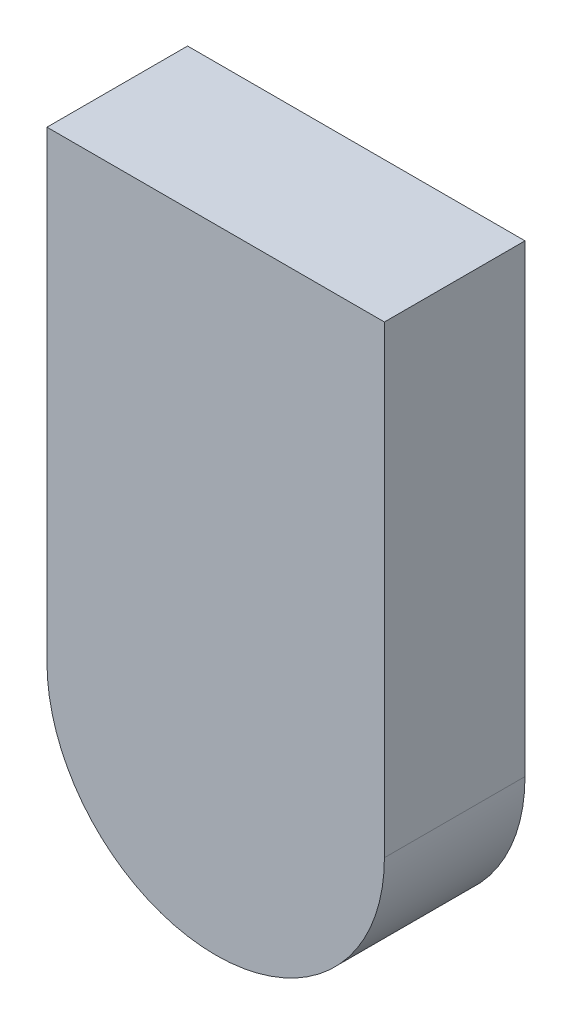
ISO-10303-21;
HEADER;
FILE_DESCRIPTION(('STEP AP214'),'2;1');
FILE_NAME('part.step','',(''),(''),'','','');
FILE_SCHEMA(('AUTOMOTIVE_DESIGN { 1 0 10303 214 1 1 1 1 }'));
ENDSEC;
DATA;
#1=APPLICATION_CONTEXT('core data for automotive mechanical design processes');
#2=APPLICATION_PROTOCOL_DEFINITION('international standard','automotive_design',2000,#1);
#3=PRODUCT_CONTEXT('',#1,'mechanical');
#4=PRODUCT('Part','Part','',(#3));
#5=PRODUCT_RELATED_PRODUCT_CATEGORY('part','',(#4));
#6=PRODUCT_DEFINITION_FORMATION('','',#4);
#7=PRODUCT_DEFINITION_CONTEXT('part definition',#1,'design');
#8=PRODUCT_DEFINITION('design','',#6,#7);
#9=PRODUCT_DEFINITION_SHAPE('','',#8);
#10=(LENGTH_UNIT() NAMED_UNIT(*) SI_UNIT(.MILLI.,.METRE.));
#11=(NAMED_UNIT(*) PLANE_ANGLE_UNIT() SI_UNIT($,.RADIAN.));
#12=(NAMED_UNIT(*) SI_UNIT($,.STERADIAN.) SOLID_ANGLE_UNIT());
#13=UNCERTAINTY_MEASURE_WITH_UNIT(LENGTH_MEASURE(1.E-05),#10,'distance_accuracy_value','');
#14=(GEOMETRIC_REPRESENTATION_CONTEXT(3) GLOBAL_UNCERTAINTY_ASSIGNED_CONTEXT((#13)) GLOBAL_UNIT_ASSIGNED_CONTEXT((#10,
#11,#12)) REPRESENTATION_CONTEXT('',''));
#15=CARTESIAN_POINT('',(0.,0.,0.));
#16=DIRECTION('',(0.,0.,1.));
#17=DIRECTION('',(1.,0.,0.));
#18=AXIS2_PLACEMENT_3D('',#15,#16,#17);
#19=CARTESIAN_POINT('',(-1.87,4.05,0.));
#20=DIRECTION('',(0.,1.,0.));
#21=DIRECTION('',(1.,0.,0.));
#22=AXIS2_PLACEMENT_3D('',#19,#20,#21);
#23=PLANE('',#22);
#24=DIRECTION('',(0.,0.,1.));
#25=VECTOR('',#24,1.);
#26=CARTESIAN_POINT('',(-1.87,4.05,0.));
#27=LINE('',#26,#25);
#28=CARTESIAN_POINT('',(-1.87,4.05,0.));
#29=VERTEX_POINT('',#28);
#30=CARTESIAN_POINT('',(-1.87,4.05,0.1));
#31=VERTEX_POINT('',#30);
#32=EDGE_CURVE('E11',#29,#31,#27,.T.);
#33=ORIENTED_EDGE('',*,*,#32,.T.);
#34=DIRECTION('',(1.,0.,0.));
#35=VECTOR('',#34,1.);
#36=CARTESIAN_POINT('',(-1.87,4.05,0.1));
#37=LINE('',#36,#35);
#38=CARTESIAN_POINT('',(-1.63,4.05,0.1));
#39=VERTEX_POINT('',#38);
#40=EDGE_CURVE('E24',#31,#39,#37,.T.);
#41=ORIENTED_EDGE('',*,*,#40,.T.);
#42=DIRECTION('',(0.,0.,1.));
#43=VECTOR('',#42,1.);
#44=CARTESIAN_POINT('',(-1.63,4.05,0.));
#45=LINE('',#44,#43);
#46=CARTESIAN_POINT('',(-1.63,4.05,0.));
#47=VERTEX_POINT('',#46);
#48=EDGE_CURVE('E85',#47,#39,#45,.T.);
#49=ORIENTED_EDGE('',*,*,#48,.F.);
#50=DIRECTION('',(1.,0.,0.));
#51=VECTOR('',#50,1.);
#52=CARTESIAN_POINT('',(-1.87,4.05,0.));
#53=LINE('',#52,#51);
#54=EDGE_CURVE('E82',#29,#47,#53,.T.);
#55=ORIENTED_EDGE('',*,*,#54,.F.);
#56=EDGE_LOOP('',(#33,#41,#49,#55));
#57=FACE_BOUND('',#56,.T.);
#58=ADVANCED_FACE('F17',(#57),#23,.T.);
#59=CARTESIAN_POINT('',(-1.63,4.05,0.));
#60=DIRECTION('',(1.,0.,0.));
#61=DIRECTION('',(0.,-1.,0.));
#62=AXIS2_PLACEMENT_3D('',#59,#60,#61);
#63=PLANE('',#62);
#64=ORIENTED_EDGE('',*,*,#48,.T.);
#65=DIRECTION('',(0.,-1.,0.));
#66=VECTOR('',#65,1.);
#67=CARTESIAN_POINT('',(-1.63,4.05,0.1));
#68=LINE('',#67,#66);
#69=CARTESIAN_POINT('',(-1.63,3.72,0.1));
#70=VERTEX_POINT('',#69);
#71=EDGE_CURVE('E80',#39,#70,#68,.T.);
#72=ORIENTED_EDGE('',*,*,#71,.T.);
#73=DIRECTION('',(0.,0.,1.));
#74=VECTOR('',#73,1.);
#75=CARTESIAN_POINT('',(-1.63,3.72,0.));
#76=LINE('',#75,#74);
#77=CARTESIAN_POINT('',(-1.63,3.72,0.));
#78=VERTEX_POINT('',#77);
#79=EDGE_CURVE('E60',#78,#70,#76,.T.);
#80=ORIENTED_EDGE('',*,*,#79,.F.);
#81=DIRECTION('',(0.,-1.,0.));
#82=VECTOR('',#81,1.);
#83=CARTESIAN_POINT('',(-1.63,4.05,0.));
#84=LINE('',#83,#82);
#85=EDGE_CURVE('E76',#47,#78,#84,.T.);
#86=ORIENTED_EDGE('',*,*,#85,.F.);
#87=EDGE_LOOP('',(#64,#72,#80,#86));
#88=FACE_BOUND('',#87,.T.);
#89=ADVANCED_FACE('F89',(#88),#63,.T.);
#90=CARTESIAN_POINT('',(-1.75,3.72,0.));
#91=DIRECTION('',(0.,0.,-1.));
#92=DIRECTION('',(1.,0.,0.));
#93=AXIS2_PLACEMENT_3D('',#90,#91,#92);
#94=CYLINDRICAL_SURFACE('',#93,0.12);
#95=CARTESIAN_POINT('',(-1.75,3.72,0.));
#96=DIRECTION('',(0.,0.,1.));
#97=DIRECTION('',(1.,0.,0.));
#98=AXIS2_PLACEMENT_3D('',#95,#96,#97);
#99=CIRCLE('',#98,0.12);
#100=CARTESIAN_POINT('',(-1.87,3.72,0.));
#101=VERTEX_POINT('',#100);
#102=EDGE_CURVE('E64',#101,#78,#99,.T.);
#103=ORIENTED_EDGE('',*,*,#102,.T.);
#104=ORIENTED_EDGE('',*,*,#79,.T.);
#105=CARTESIAN_POINT('',(-1.75,3.72,0.1));
#106=DIRECTION('',(0.,0.,1.));
#107=DIRECTION('',(1.,0.,0.));
#108=AXIS2_PLACEMENT_3D('',#105,#106,#107);
#109=CIRCLE('',#108,0.12);
#110=CARTESIAN_POINT('',(-1.87,3.72,0.1));
#111=VERTEX_POINT('',#110);
#112=EDGE_CURVE('E55',#111,#70,#109,.T.);
#113=ORIENTED_EDGE('',*,*,#112,.F.);
#114=DIRECTION('',(0.,0.,1.));
#115=VECTOR('',#114,1.);
#116=CARTESIAN_POINT('',(-1.87,3.72,0.));
#117=LINE('',#116,#115);
#118=EDGE_CURVE('E59',#101,#111,#117,.T.);
#119=ORIENTED_EDGE('',*,*,#118,.F.);
#120=EDGE_LOOP('',(#103,#104,#113,#119));
#121=FACE_BOUND('',#120,.T.);
#122=ADVANCED_FACE('F58',(#121),#94,.T.);
#123=CARTESIAN_POINT('',(-1.87,4.05,0.));
#124=DIRECTION('',(1.,0.,0.));
#125=DIRECTION('',(0.,-1.,0.));
#126=AXIS2_PLACEMENT_3D('',#123,#124,#125);
#127=PLANE('',#126);
#128=DIRECTION('',(0.,-1.,0.));
#129=VECTOR('',#128,1.);
#130=CARTESIAN_POINT('',(-1.87,4.05,0.));
#131=LINE('',#130,#129);
#132=EDGE_CURVE('E69',#29,#101,#131,.T.);
#133=ORIENTED_EDGE('',*,*,#132,.T.);
#134=ORIENTED_EDGE('',*,*,#118,.T.);
#135=DIRECTION('',(0.,-1.,0.));
#136=VECTOR('',#135,1.);
#137=CARTESIAN_POINT('',(-1.87,4.05,0.1));
#138=LINE('',#137,#136);
#139=EDGE_CURVE('E67',#31,#111,#138,.T.);
#140=ORIENTED_EDGE('',*,*,#139,.F.);
#141=ORIENTED_EDGE('',*,*,#32,.F.);
#142=EDGE_LOOP('',(#133,#134,#140,#141));
#143=FACE_BOUND('',#142,.T.);
#144=ADVANCED_FACE('F66',(#143),#127,.F.);
#145=CARTESIAN_POINT('',(-1.75,3.849490847913,0.));
#146=DIRECTION('',(0.,0.,-1.));
#147=DIRECTION('',(-1.,0.,0.));
#148=AXIS2_PLACEMENT_3D('',#145,#146,#147);
#149=PLANE('',#148);
#150=ORIENTED_EDGE('',*,*,#54,.T.);
#151=ORIENTED_EDGE('',*,*,#85,.T.);
#152=ORIENTED_EDGE('',*,*,#102,.F.);
#153=ORIENTED_EDGE('',*,*,#132,.F.);
#154=EDGE_LOOP('',(#150,#151,#152,#153));
#155=FACE_BOUND('',#154,.T.);
#156=ADVANCED_FACE('F91',(#155),#149,.T.);
#157=CARTESIAN_POINT('',(-1.75,3.849490847913,0.1));
#158=DIRECTION('',(0.,0.,-1.));
#159=DIRECTION('',(-1.,0.,0.));
#160=AXIS2_PLACEMENT_3D('',#157,#158,#159);
#161=PLANE('',#160);
#162=ORIENTED_EDGE('',*,*,#139,.T.);
#163=ORIENTED_EDGE('',*,*,#112,.T.);
#164=ORIENTED_EDGE('',*,*,#71,.F.);
#165=ORIENTED_EDGE('',*,*,#40,.F.);
#166=EDGE_LOOP('',(#162,#163,#164,#165));
#167=FACE_BOUND('',#166,.T.);
#168=ADVANCED_FACE('F71',(#167),#161,.F.);
#169=CLOSED_SHELL('',(#58,#89,#122,#144,#156,#168));
#170=MANIFOLD_SOLID_BREP('B1',#169);
#171=ADVANCED_BREP_SHAPE_REPRESENTATION('',(#18,#170),#14);
#172=SHAPE_DEFINITION_REPRESENTATION(#9,#171);
ENDSEC;
END-ISO-10303-21;
